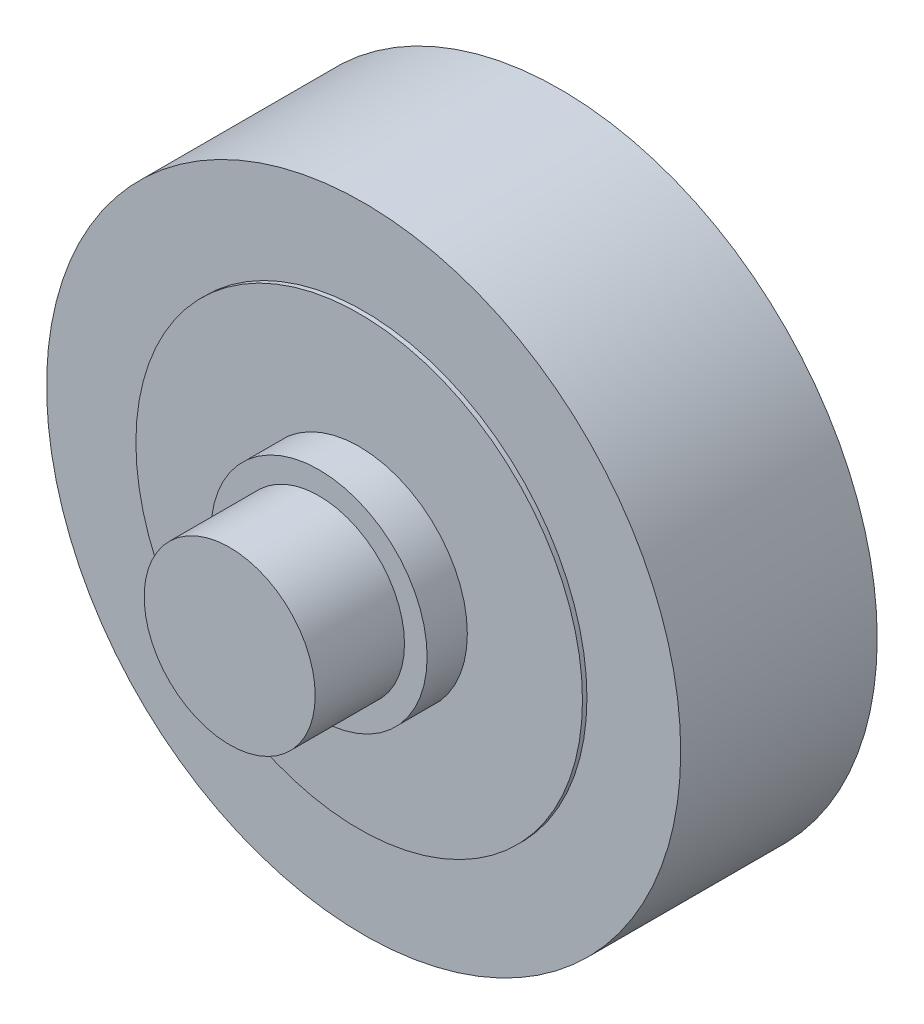
ISO-10303-21;
HEADER;
FILE_DESCRIPTION(('STEP AP214'),'2;1');
FILE_NAME('part.step','',(''),(''),'','','');
FILE_SCHEMA(('AUTOMOTIVE_DESIGN { 1 0 10303 214 1 1 1 1 }'));
ENDSEC;
DATA;
#1=APPLICATION_CONTEXT('core data for automotive mechanical design processes');
#2=APPLICATION_PROTOCOL_DEFINITION('international standard','automotive_design',2000,#1);
#3=PRODUCT_CONTEXT('',#1,'mechanical');
#4=PRODUCT('Part','Part','',(#3));
#5=PRODUCT_RELATED_PRODUCT_CATEGORY('part','',(#4));
#6=PRODUCT_DEFINITION_FORMATION('','',#4);
#7=PRODUCT_DEFINITION_CONTEXT('part definition',#1,'design');
#8=PRODUCT_DEFINITION('design','',#6,#7);
#9=PRODUCT_DEFINITION_SHAPE('','',#8);
#10=(LENGTH_UNIT() NAMED_UNIT(*) SI_UNIT(.MILLI.,.METRE.));
#11=(NAMED_UNIT(*) PLANE_ANGLE_UNIT() SI_UNIT($,.RADIAN.));
#12=(NAMED_UNIT(*) SI_UNIT($,.STERADIAN.) SOLID_ANGLE_UNIT());
#13=UNCERTAINTY_MEASURE_WITH_UNIT(LENGTH_MEASURE(1.E-05),#10,'distance_accuracy_value','');
#14=(GEOMETRIC_REPRESENTATION_CONTEXT(3) GLOBAL_UNCERTAINTY_ASSIGNED_CONTEXT((#13)) GLOBAL_UNIT_ASSIGNED_CONTEXT((#10,
#11,#12)) REPRESENTATION_CONTEXT('',''));
#15=CARTESIAN_POINT('',(0.,0.,0.));
#16=DIRECTION('',(0.,0.,1.));
#17=DIRECTION('',(1.,0.,0.));
#18=AXIS2_PLACEMENT_3D('',#15,#16,#17);
#19=CARTESIAN_POINT('',(0.,0.,44.));
#20=DIRECTION('',(0.,0.,1.));
#21=DIRECTION('',(1.,0.,0.));
#22=AXIS2_PLACEMENT_3D('',#19,#20,#21);
#23=PLANE('',#22);
#24=CARTESIAN_POINT('',(0.,0.,44.));
#25=DIRECTION('',(0.,0.,1.));
#26=DIRECTION('',(1.,0.,0.));
#27=AXIS2_PLACEMENT_3D('',#24,#25,#26);
#28=CIRCLE('',#27,71.);
#29=CARTESIAN_POINT('',(71.,0.,44.));
#30=VERTEX_POINT('',#29);
#31=EDGE_CURVE('E10',#30,#30,#28,.T.);
#32=ORIENTED_EDGE('',*,*,#31,.T.);
#33=EDGE_LOOP('',(#32));
#34=FACE_BOUND('',#33,.T.);
#35=CARTESIAN_POINT('',(0.,0.,44.));
#36=DIRECTION('',(0.,0.,1.));
#37=DIRECTION('',(1.,0.,0.));
#38=AXIS2_PLACEMENT_3D('',#35,#36,#37);
#39=CIRCLE('',#38,50.);
#40=CARTESIAN_POINT('',(50.,0.,44.));
#41=VERTEX_POINT('',#40);
#42=EDGE_CURVE('E50',#41,#41,#39,.T.);
#43=ORIENTED_EDGE('',*,*,#42,.F.);
#44=EDGE_LOOP('',(#43));
#45=FACE_BOUND('',#44,.T.);
#46=ADVANCED_FACE('F37',(#34,#45),#23,.T.);
#47=CARTESIAN_POINT('',(0.,0.,0.));
#48=DIRECTION('',(0.,0.,1.));
#49=DIRECTION('',(1.,0.,0.));
#50=AXIS2_PLACEMENT_3D('',#47,#48,#49);
#51=PLANE('',#50);
#52=CARTESIAN_POINT('',(0.,0.,0.));
#53=DIRECTION('',(0.,0.,1.));
#54=DIRECTION('',(1.,0.,0.));
#55=AXIS2_PLACEMENT_3D('',#52,#53,#54);
#56=CIRCLE('',#55,71.);
#57=CARTESIAN_POINT('',(71.,0.,0.));
#58=VERTEX_POINT('',#57);
#59=EDGE_CURVE('E41',#58,#58,#56,.T.);
#60=ORIENTED_EDGE('',*,*,#59,.F.);
#61=EDGE_LOOP('',(#60));
#62=FACE_BOUND('',#61,.T.);
#63=CARTESIAN_POINT('',(0.,0.,0.));
#64=DIRECTION('',(0.,0.,1.));
#65=DIRECTION('',(1.,0.,0.));
#66=AXIS2_PLACEMENT_3D('',#63,#64,#65);
#67=CIRCLE('',#66,24.2162882893883);
#68=CARTESIAN_POINT('',(24.2162882893883,0.,0.));
#69=VERTEX_POINT('',#68);
#70=EDGE_CURVE('E63',#69,#69,#67,.T.);
#71=ORIENTED_EDGE('',*,*,#70,.T.);
#72=EDGE_LOOP('',(#71));
#73=FACE_BOUND('',#72,.T.);
#74=ADVANCED_FACE('F108',(#62,#73),#51,.F.);
#75=CARTESIAN_POINT('',(0.,0.,44.));
#76=DIRECTION('',(0.,0.,-1.));
#77=DIRECTION('',(-1.,0.,0.));
#78=AXIS2_PLACEMENT_3D('',#75,#76,#77);
#79=CYLINDRICAL_SURFACE('',#78,71.);
#80=ORIENTED_EDGE('',*,*,#31,.F.);
#81=EDGE_LOOP('',(#80));
#82=FACE_BOUND('',#81,.T.);
#83=ORIENTED_EDGE('',*,*,#59,.T.);
#84=EDGE_LOOP('',(#83));
#85=FACE_BOUND('',#84,.T.);
#86=ADVANCED_FACE('F39',(#82,#85),#79,.T.);
#87=CARTESIAN_POINT('',(0.,0.,0.));
#88=DIRECTION('',(0.,0.,1.));
#89=DIRECTION('',(1.,0.,0.));
#90=AXIS2_PLACEMENT_3D('',#87,#88,#89);
#91=CYLINDRICAL_SURFACE('',#90,50.);
#92=ORIENTED_EDGE('',*,*,#42,.T.);
#93=EDGE_LOOP('',(#92));
#94=FACE_BOUND('',#93,.T.);
#95=CARTESIAN_POINT('',(0.,0.,45.));
#96=DIRECTION('',(0.,0.,1.));
#97=DIRECTION('',(1.,0.,0.));
#98=AXIS2_PLACEMENT_3D('',#95,#96,#97);
#99=CIRCLE('',#98,50.);
#100=CARTESIAN_POINT('',(50.,0.,45.));
#101=VERTEX_POINT('',#100);
#102=EDGE_CURVE('E55',#101,#101,#99,.T.);
#103=ORIENTED_EDGE('',*,*,#102,.F.);
#104=EDGE_LOOP('',(#103));
#105=FACE_BOUND('',#104,.T.);
#106=ADVANCED_FACE('F116',(#94,#105),#91,.T.);
#107=CARTESIAN_POINT('',(0.,0.,45.));
#108=DIRECTION('',(0.,0.,1.));
#109=DIRECTION('',(1.,0.,0.));
#110=AXIS2_PLACEMENT_3D('',#107,#108,#109);
#111=PLANE('',#110);
#112=ORIENTED_EDGE('',*,*,#102,.T.);
#113=EDGE_LOOP('',(#112));
#114=FACE_BOUND('',#113,.T.);
#115=CARTESIAN_POINT('',(0.,0.,45.));
#116=DIRECTION('',(0.,0.,1.));
#117=DIRECTION('',(1.,0.,0.));
#118=AXIS2_PLACEMENT_3D('',#115,#116,#117);
#119=CIRCLE('',#118,24.2162882893883);
#120=CARTESIAN_POINT('',(24.2162882893883,0.,45.));
#121=VERTEX_POINT('',#120);
#122=EDGE_CURVE('E59',#121,#121,#119,.T.);
#123=ORIENTED_EDGE('',*,*,#122,.F.);
#124=EDGE_LOOP('',(#123));
#125=FACE_BOUND('',#124,.T.);
#126=ADVANCED_FACE('F119',(#114,#125),#111,.T.);
#127=CARTESIAN_POINT('',(0.,0.,-9.99999999999996));
#128=DIRECTION('',(0.,0.,1.));
#129=DIRECTION('',(1.,0.,0.));
#130=AXIS2_PLACEMENT_3D('',#127,#128,#129);
#131=CYLINDRICAL_SURFACE('',#130,24.2162882893883);
#132=CARTESIAN_POINT('',(0.,0.,-9.99999999999996));
#133=DIRECTION('',(0.,0.,1.));
#134=DIRECTION('',(1.,0.,0.));
#135=AXIS2_PLACEMENT_3D('',#132,#133,#134);
#136=CIRCLE('',#135,24.2162882893883);
#137=CARTESIAN_POINT('',(24.2162882893883,0.,-9.99999999999996));
#138=VERTEX_POINT('',#137);
#139=EDGE_CURVE('E67',#138,#138,#136,.T.);
#140=ORIENTED_EDGE('',*,*,#139,.T.);
#141=EDGE_LOOP('',(#140));
#142=FACE_BOUND('',#141,.T.);
#143=ORIENTED_EDGE('',*,*,#70,.F.);
#144=EDGE_LOOP('',(#143));
#145=FACE_BOUND('',#144,.T.);
#146=ADVANCED_FACE('F123',(#142,#145),#131,.T.);
#147=ORIENTED_EDGE('',*,*,#122,.T.);
#148=EDGE_LOOP('',(#147));
#149=FACE_BOUND('',#148,.T.);
#150=CARTESIAN_POINT('',(0.,0.,54.));
#151=DIRECTION('',(0.,0.,1.));
#152=DIRECTION('',(1.,0.,0.));
#153=AXIS2_PLACEMENT_3D('',#150,#151,#152);
#154=CIRCLE('',#153,24.2162882893883);
#155=CARTESIAN_POINT('',(24.2162882893883,0.,54.));
#156=VERTEX_POINT('',#155);
#157=EDGE_CURVE('E71',#156,#156,#154,.T.);
#158=ORIENTED_EDGE('',*,*,#157,.F.);
#159=EDGE_LOOP('',(#158));
#160=FACE_BOUND('',#159,.T.);
#161=ADVANCED_FACE('F125',(#149,#160),#131,.T.);
#162=CARTESIAN_POINT('',(0.,0.,-9.99999999999996));
#163=DIRECTION('',(0.,0.,1.));
#164=DIRECTION('',(1.,0.,0.));
#165=AXIS2_PLACEMENT_3D('',#162,#163,#164);
#166=PLANE('',#165);
#167=CARTESIAN_POINT('',(0.,0.,-9.99999999999996));
#168=DIRECTION('',(0.,0.,1.));
#169=DIRECTION('',(1.,0.,0.));
#170=AXIS2_PLACEMENT_3D('',#167,#168,#169);
#171=CIRCLE('',#170,19.1502593618802);
#172=CARTESIAN_POINT('',(19.1502593618802,0.,-9.99999999999996));
#173=VERTEX_POINT('',#172);
#174=EDGE_CURVE('E79',#173,#173,#171,.T.);
#175=ORIENTED_EDGE('',*,*,#174,.T.);
#176=EDGE_LOOP('',(#175));
#177=FACE_BOUND('',#176,.T.);
#178=ORIENTED_EDGE('',*,*,#139,.F.);
#179=EDGE_LOOP('',(#178));
#180=FACE_BOUND('',#179,.T.);
#181=ADVANCED_FACE('F128',(#177,#180),#166,.F.);
#182=CARTESIAN_POINT('',(0.,0.,54.));
#183=DIRECTION('',(0.,0.,1.));
#184=DIRECTION('',(1.,0.,0.));
#185=AXIS2_PLACEMENT_3D('',#182,#183,#184);
#186=PLANE('',#185);
#187=ORIENTED_EDGE('',*,*,#157,.T.);
#188=EDGE_LOOP('',(#187));
#189=FACE_BOUND('',#188,.T.);
#190=CARTESIAN_POINT('',(0.,0.,54.));
#191=DIRECTION('',(0.,0.,1.));
#192=DIRECTION('',(1.,0.,0.));
#193=AXIS2_PLACEMENT_3D('',#190,#191,#192);
#194=CIRCLE('',#193,19.1502593618802);
#195=CARTESIAN_POINT('',(19.1502593618802,0.,54.));
#196=VERTEX_POINT('',#195);
#197=EDGE_CURVE('E75',#196,#196,#194,.T.);
#198=ORIENTED_EDGE('',*,*,#197,.F.);
#199=EDGE_LOOP('',(#198));
#200=FACE_BOUND('',#199,.T.);
#201=ADVANCED_FACE('F132',(#189,#200),#186,.T.);
#202=CARTESIAN_POINT('',(0.,0.,-30.));
#203=DIRECTION('',(0.,0.,1.));
#204=DIRECTION('',(1.,0.,0.));
#205=AXIS2_PLACEMENT_3D('',#202,#203,#204);
#206=CYLINDRICAL_SURFACE('',#205,19.1502593618802);
#207=CARTESIAN_POINT('',(0.,0.,-30.));
#208=DIRECTION('',(0.,0.,1.));
#209=DIRECTION('',(1.,0.,0.));
#210=AXIS2_PLACEMENT_3D('',#207,#208,#209);
#211=CIRCLE('',#210,19.1502593618802);
#212=CARTESIAN_POINT('',(19.1502593618802,0.,-30.));
#213=VERTEX_POINT('',#212);
#214=EDGE_CURVE('E83',#213,#213,#211,.T.);
#215=ORIENTED_EDGE('',*,*,#214,.T.);
#216=EDGE_LOOP('',(#215));
#217=FACE_BOUND('',#216,.T.);
#218=ORIENTED_EDGE('',*,*,#174,.F.);
#219=EDGE_LOOP('',(#218));
#220=FACE_BOUND('',#219,.T.);
#221=ADVANCED_FACE('F104',(#217,#220),#206,.T.);
#222=CARTESIAN_POINT('',(0.,0.,-30.));
#223=DIRECTION('',(0.,0.,1.));
#224=DIRECTION('',(1.,0.,0.));
#225=AXIS2_PLACEMENT_3D('',#222,#223,#224);
#226=PLANE('',#225);
#227=ORIENTED_EDGE('',*,*,#214,.F.);
#228=EDGE_LOOP('',(#227));
#229=FACE_BOUND('',#228,.T.);
#230=ADVANCED_FACE('F96',(#229),#226,.F.);
#231=CARTESIAN_POINT('',(0.,0.,74.));
#232=DIRECTION('',(0.,0.,-1.));
#233=DIRECTION('',(-1.,0.,0.));
#234=AXIS2_PLACEMENT_3D('',#231,#232,#233);
#235=CYLINDRICAL_SURFACE('',#234,19.1502593618802);
#236=ORIENTED_EDGE('',*,*,#197,.T.);
#237=EDGE_LOOP('',(#236));
#238=FACE_BOUND('',#237,.T.);
#239=CARTESIAN_POINT('',(0.,0.,74.));
#240=DIRECTION('',(0.,0.,1.));
#241=DIRECTION('',(1.,0.,0.));
#242=AXIS2_PLACEMENT_3D('',#239,#240,#241);
#243=CIRCLE('',#242,19.1502593618802);
#244=CARTESIAN_POINT('',(19.1502593618802,0.,74.));
#245=VERTEX_POINT('',#244);
#246=EDGE_CURVE('E87',#245,#245,#243,.T.);
#247=ORIENTED_EDGE('',*,*,#246,.F.);
#248=EDGE_LOOP('',(#247));
#249=FACE_BOUND('',#248,.T.);
#250=ADVANCED_FACE('F94',(#238,#249),#235,.T.);
#251=CARTESIAN_POINT('',(0.,0.,74.));
#252=DIRECTION('',(0.,0.,1.));
#253=DIRECTION('',(1.,0.,0.));
#254=AXIS2_PLACEMENT_3D('',#251,#252,#253);
#255=PLANE('',#254);
#256=ORIENTED_EDGE('',*,*,#246,.T.);
#257=EDGE_LOOP('',(#256));
#258=FACE_BOUND('',#257,.T.);
#259=ADVANCED_FACE('F92',(#258),#255,.T.);
#260=CLOSED_SHELL('',(#46,#74,#86,#106,#126,#146,#161,#181,#201,#221,#230,#250,#259));
#261=MANIFOLD_SOLID_BREP('B2',#260);
#262=ADVANCED_BREP_SHAPE_REPRESENTATION('',(#18,#261),#14);
#263=SHAPE_DEFINITION_REPRESENTATION(#9,#262);
ENDSEC;
END-ISO-10303-21;
